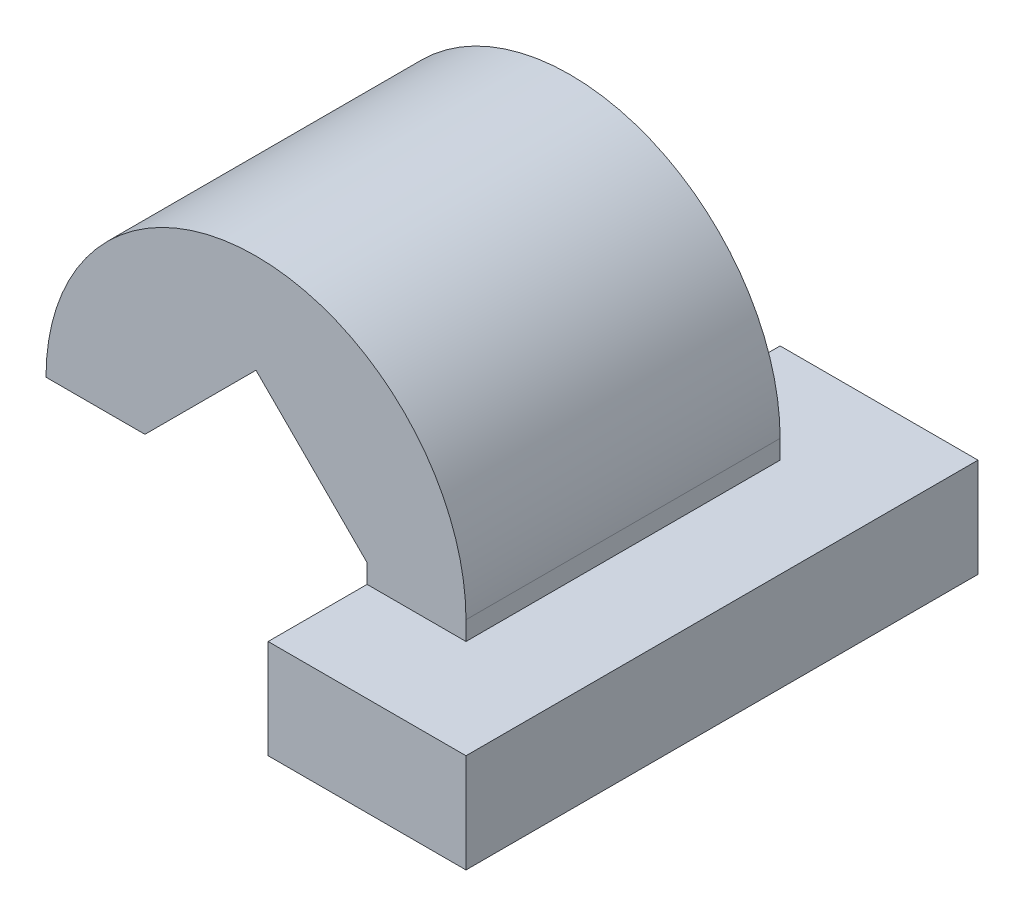
ISO-10303-21;
HEADER;
FILE_DESCRIPTION(('STEP AP214'),'2;1');
FILE_NAME('part.step','',(''),(''),'','','');
FILE_SCHEMA(('AUTOMOTIVE_DESIGN { 1 0 10303 214 1 1 1 1 }'));
ENDSEC;
DATA;
#1=APPLICATION_CONTEXT('core data for automotive mechanical design processes');
#2=APPLICATION_PROTOCOL_DEFINITION('international standard','automotive_design',2000,#1);
#3=PRODUCT_CONTEXT('',#1,'mechanical');
#4=PRODUCT('Part','Part','',(#3));
#5=PRODUCT_RELATED_PRODUCT_CATEGORY('part','',(#4));
#6=PRODUCT_DEFINITION_FORMATION('','',#4);
#7=PRODUCT_DEFINITION_CONTEXT('part definition',#1,'design');
#8=PRODUCT_DEFINITION('design','',#6,#7);
#9=PRODUCT_DEFINITION_SHAPE('','',#8);
#10=(LENGTH_UNIT() NAMED_UNIT(*) SI_UNIT(.MILLI.,.METRE.));
#11=(NAMED_UNIT(*) PLANE_ANGLE_UNIT() SI_UNIT($,.RADIAN.));
#12=(NAMED_UNIT(*) SI_UNIT($,.STERADIAN.) SOLID_ANGLE_UNIT());
#13=UNCERTAINTY_MEASURE_WITH_UNIT(LENGTH_MEASURE(1.E-05),#10,'distance_accuracy_value','');
#14=(GEOMETRIC_REPRESENTATION_CONTEXT(3) GLOBAL_UNCERTAINTY_ASSIGNED_CONTEXT((#13)) GLOBAL_UNIT_ASSIGNED_CONTEXT((#10,
#11,#12)) REPRESENTATION_CONTEXT('',''));
#15=CARTESIAN_POINT('',(0.,0.,0.));
#16=DIRECTION('',(0.,0.,1.));
#17=DIRECTION('',(1.,0.,0.));
#18=AXIS2_PLACEMENT_3D('',#15,#16,#17);
#19=CARTESIAN_POINT('',(4.24506403026727,0.,31.75));
#20=DIRECTION('',(-1.,0.,0.));
#21=DIRECTION('',(0.,-1.,0.));
#22=AXIS2_PLACEMENT_3D('',#19,#20,#21);
#23=PLANE('',#22);
#24=DIRECTION('',(0.,0.,-1.));
#25=VECTOR('',#24,1.);
#26=CARTESIAN_POINT('',(4.24506403026728,2.,31.75));
#27=LINE('',#26,#25);
#28=CARTESIAN_POINT('',(4.24506403026728,2.,31.75));
#29=VERTEX_POINT('',#28);
#30=CARTESIAN_POINT('',(4.24506403026728,2.,25.4));
#31=VERTEX_POINT('',#30);
#32=EDGE_CURVE('E47',#29,#31,#27,.T.);
#33=ORIENTED_EDGE('',*,*,#32,.F.);
#34=DIRECTION('',(0.,-1.,0.));
#35=VECTOR('',#34,1.);
#36=CARTESIAN_POINT('',(4.24506403026728,4.38125,31.75));
#37=LINE('',#36,#35);
#38=CARTESIAN_POINT('',(4.24506403026727,0.,31.75));
#39=VERTEX_POINT('',#38);
#40=EDGE_CURVE('E180',#29,#39,#37,.T.);
#41=ORIENTED_EDGE('',*,*,#40,.T.);
#42=DIRECTION('',(0.,0.,-1.));
#43=VECTOR('',#42,1.);
#44=CARTESIAN_POINT('',(4.24506403026727,0.,31.75));
#45=LINE('',#44,#43);
#46=CARTESIAN_POINT('',(4.24506403026727,0.,25.4));
#47=VERTEX_POINT('',#46);
#48=EDGE_CURVE('E140',#39,#47,#45,.T.);
#49=ORIENTED_EDGE('',*,*,#48,.T.);
#50=DIRECTION('',(0.,1.,0.));
#51=VECTOR('',#50,1.);
#52=CARTESIAN_POINT('',(4.24506403026727,0.,25.4));
#53=LINE('',#52,#51);
#54=EDGE_CURVE('E163',#47,#31,#53,.T.);
#55=ORIENTED_EDGE('',*,*,#54,.T.);
#56=EDGE_LOOP('',(#33,#41,#49,#55));
#57=FACE_BOUND('',#56,.T.);
#58=ADVANCED_FACE('F32',(#57),#23,.F.);
#59=CARTESIAN_POINT('',(0.,4.38125,31.75));
#60=DIRECTION('',(0.,0.,-1.));
#61=DIRECTION('',(-1.,0.,0.));
#62=AXIS2_PLACEMENT_3D('',#59,#60,#61);
#63=PLANE('',#62);
#64=DIRECTION('',(1.,0.,0.));
#65=VECTOR('',#64,1.);
#66=CARTESIAN_POINT('',(0.,2.,31.75));
#67=LINE('',#66,#65);
#68=CARTESIAN_POINT('',(2.24506403026728,2.,31.75));
#69=VERTEX_POINT('',#68);
#70=EDGE_CURVE('E188',#69,#29,#67,.T.);
#71=ORIENTED_EDGE('',*,*,#70,.F.);
#72=DIRECTION('',(0.,-1.,0.));
#73=VECTOR('',#72,1.);
#74=CARTESIAN_POINT('',(2.24506403026728,2.,31.75));
#75=LINE('',#74,#73);
#76=CARTESIAN_POINT('',(2.24506403026728,0.,31.75));
#77=VERTEX_POINT('',#76);
#78=EDGE_CURVE('E122',#69,#77,#75,.T.);
#79=ORIENTED_EDGE('',*,*,#78,.T.);
#80=DIRECTION('',(1.,0.,0.));
#81=VECTOR('',#80,1.);
#82=CARTESIAN_POINT('',(2.24506403026728,0.,31.75));
#83=LINE('',#82,#81);
#84=EDGE_CURVE('E174',#77,#39,#83,.T.);
#85=ORIENTED_EDGE('',*,*,#84,.T.);
#86=ORIENTED_EDGE('',*,*,#40,.F.);
#87=EDGE_LOOP('',(#71,#79,#85,#86));
#88=FACE_BOUND('',#87,.T.);
#89=ADVANCED_FACE('F293',(#88),#63,.F.);
#90=CARTESIAN_POINT('',(0.,4.38125,25.4));
#91=DIRECTION('',(0.,0.,-1.));
#92=DIRECTION('',(-1.,0.,0.));
#93=AXIS2_PLACEMENT_3D('',#90,#91,#92);
#94=PLANE('',#93);
#95=DIRECTION('',(0.,-1.,0.));
#96=VECTOR('',#95,1.);
#97=CARTESIAN_POINT('',(2.24506403026728,4.38125000000001,25.4));
#98=LINE('',#97,#96);
#99=CARTESIAN_POINT('',(2.24506403026728,2.,25.4));
#100=VERTEX_POINT('',#99);
#101=CARTESIAN_POINT('',(2.24506403026728,0.,25.4));
#102=VERTEX_POINT('',#101);
#103=EDGE_CURVE('E160',#100,#102,#98,.T.);
#104=ORIENTED_EDGE('',*,*,#103,.F.);
#105=DIRECTION('',(1.,0.,0.));
#106=VECTOR('',#105,1.);
#107=CARTESIAN_POINT('',(0.,2.,25.4));
#108=LINE('',#107,#106);
#109=EDGE_CURVE('E40',#100,#31,#108,.T.);
#110=ORIENTED_EDGE('',*,*,#109,.T.);
#111=ORIENTED_EDGE('',*,*,#54,.F.);
#112=DIRECTION('',(1.,0.,0.));
#113=VECTOR('',#112,1.);
#114=CARTESIAN_POINT('',(2.24506403026728,0.,25.4));
#115=LINE('',#114,#113);
#116=EDGE_CURVE('E161',#102,#47,#115,.T.);
#117=ORIENTED_EDGE('',*,*,#116,.F.);
#118=EDGE_LOOP('',(#104,#110,#111,#117));
#119=FACE_BOUND('',#118,.T.);
#120=ADVANCED_FACE('F287',(#119),#94,.T.);
#121=CARTESIAN_POINT('',(-2.24506403026728,4.38125,31.75));
#122=DIRECTION('',(0.,-1.,0.));
#123=DIRECTION('',(1.,0.,0.));
#124=AXIS2_PLACEMENT_3D('',#121,#122,#123);
#125=PLANE('',#124);
#126=DIRECTION('',(-1.,0.,0.));
#127=VECTOR('',#126,1.);
#128=CARTESIAN_POINT('',(-2.24506403026728,4.38125,25.4));
#129=LINE('',#128,#127);
#130=CARTESIAN_POINT('',(-2.24506403026728,4.38125,25.4));
#131=VERTEX_POINT('',#130);
#132=CARTESIAN_POINT('',(-4.24506403026728,4.38125,25.4));
#133=VERTEX_POINT('',#132);
#134=EDGE_CURVE('E169',#131,#133,#129,.T.);
#135=ORIENTED_EDGE('',*,*,#134,.F.);
#136=DIRECTION('',(0.,0.,-1.));
#137=VECTOR('',#136,1.);
#138=CARTESIAN_POINT('',(-2.24506403026728,4.38125,31.75));
#139=LINE('',#138,#137);
#140=CARTESIAN_POINT('',(-2.24506403026728,4.38125,31.75));
#141=VERTEX_POINT('',#140);
#142=EDGE_CURVE('E56',#141,#131,#139,.T.);
#143=ORIENTED_EDGE('',*,*,#142,.F.);
#144=DIRECTION('',(-1.,0.,0.));
#145=VECTOR('',#144,1.);
#146=CARTESIAN_POINT('',(-2.24506403026728,4.38125,31.75));
#147=LINE('',#146,#145);
#148=CARTESIAN_POINT('',(-4.24506403026728,4.38125,31.75));
#149=VERTEX_POINT('',#148);
#150=EDGE_CURVE('E156',#141,#149,#147,.T.);
#151=ORIENTED_EDGE('',*,*,#150,.T.);
#152=DIRECTION('',(0.,0.,-1.));
#153=VECTOR('',#152,1.);
#154=CARTESIAN_POINT('',(-4.24506403026728,4.38125,31.75));
#155=LINE('',#154,#153);
#156=EDGE_CURVE('E91',#149,#133,#155,.T.);
#157=ORIENTED_EDGE('',*,*,#156,.T.);
#158=EDGE_LOOP('',(#135,#143,#151,#157));
#159=FACE_BOUND('',#158,.T.);
#160=ADVANCED_FACE('F34',(#159),#125,.T.);
#161=CARTESIAN_POINT('',(-2.24506403026728,4.38125,31.75));
#162=DIRECTION('',(-0.707106781186549,0.707106781186546,0.));
#163=DIRECTION('',(-0.707106781186546,-0.707106781186549,0.));
#164=AXIS2_PLACEMENT_3D('',#161,#162,#163);
#165=PLANE('',#164);
#166=DIRECTION('',(0.707106781186546,0.707106781186549,0.));
#167=VECTOR('',#166,1.);
#168=CARTESIAN_POINT('',(-2.24506403026728,4.38125,25.4));
#169=LINE('',#168,#167);
#170=CARTESIAN_POINT('',(0.,6.62631403026729,25.4));
#171=VERTEX_POINT('',#170);
#172=EDGE_CURVE('E154',#131,#171,#169,.T.);
#173=ORIENTED_EDGE('',*,*,#172,.T.);
#174=DIRECTION('',(0.,0.,-1.));
#175=VECTOR('',#174,1.);
#176=CARTESIAN_POINT('',(0.,6.62631403026729,31.75));
#177=LINE('',#176,#175);
#178=CARTESIAN_POINT('',(0.,6.62631403026729,31.75));
#179=VERTEX_POINT('',#178);
#180=EDGE_CURVE('E135',#179,#171,#177,.T.);
#181=ORIENTED_EDGE('',*,*,#180,.F.);
#182=DIRECTION('',(0.707106781186546,0.707106781186549,0.));
#183=VECTOR('',#182,1.);
#184=CARTESIAN_POINT('',(-2.24506403026728,4.38125,31.75));
#185=LINE('',#184,#183);
#186=EDGE_CURVE('E127',#141,#179,#185,.T.);
#187=ORIENTED_EDGE('',*,*,#186,.F.);
#188=ORIENTED_EDGE('',*,*,#142,.T.);
#189=EDGE_LOOP('',(#173,#181,#187,#188));
#190=FACE_BOUND('',#189,.T.);
#191=ADVANCED_FACE('F286',(#190),#165,.F.);
#192=CARTESIAN_POINT('',(0.,6.62631403026729,31.75));
#193=DIRECTION('',(0.707106781186546,0.707106781186549,0.));
#194=DIRECTION('',(-0.707106781186549,0.707106781186546,0.));
#195=AXIS2_PLACEMENT_3D('',#192,#193,#194);
#196=PLANE('',#195);
#197=DIRECTION('',(0.707106781186549,-0.707106781186546,0.));
#198=VECTOR('',#197,1.);
#199=CARTESIAN_POINT('',(0.,6.62631403026729,25.4));
#200=LINE('',#199,#198);
#201=CARTESIAN_POINT('',(2.24506403026728,4.38125000000001,25.4));
#202=VERTEX_POINT('',#201);
#203=EDGE_CURVE('E134',#171,#202,#200,.T.);
#204=ORIENTED_EDGE('',*,*,#203,.T.);
#205=DIRECTION('',(0.,0.,-1.));
#206=VECTOR('',#205,1.);
#207=CARTESIAN_POINT('',(2.24506403026728,4.38125000000001,31.75));
#208=LINE('',#207,#206);
#209=CARTESIAN_POINT('',(2.24506403026728,4.38125000000001,31.75));
#210=VERTEX_POINT('',#209);
#211=EDGE_CURVE('E113',#210,#202,#208,.T.);
#212=ORIENTED_EDGE('',*,*,#211,.F.);
#213=DIRECTION('',(0.707106781186549,-0.707106781186546,0.));
#214=VECTOR('',#213,1.);
#215=CARTESIAN_POINT('',(0.,6.62631403026729,31.75));
#216=LINE('',#215,#214);
#217=EDGE_CURVE('E121',#179,#210,#216,.T.);
#218=ORIENTED_EDGE('',*,*,#217,.F.);
#219=ORIENTED_EDGE('',*,*,#180,.T.);
#220=EDGE_LOOP('',(#204,#212,#218,#219));
#221=FACE_BOUND('',#220,.T.);
#222=ADVANCED_FACE('F132',(#221),#196,.F.);
#223=CARTESIAN_POINT('',(2.24506403026728,4.38125000000001,31.75));
#224=DIRECTION('',(1.,0.,0.));
#225=DIRECTION('',(0.,0.,-1.));
#226=AXIS2_PLACEMENT_3D('',#223,#224,#225);
#227=PLANE('',#226);
#228=CARTESIAN_POINT('',(2.24506403026728,4.,25.4));
#229=VERTEX_POINT('',#228);
#230=EDGE_CURVE('E158',#202,#229,#98,.T.);
#231=ORIENTED_EDGE('',*,*,#230,.T.);
#232=DIRECTION('',(0.,0.,1.));
#233=VECTOR('',#232,1.);
#234=CARTESIAN_POINT('',(2.24506403026728,4.,23.4));
#235=LINE('',#234,#233);
#236=CARTESIAN_POINT('',(2.24506403026728,4.,23.4));
#237=VERTEX_POINT('',#236);
#238=EDGE_CURVE('E225',#237,#229,#235,.T.);
#239=ORIENTED_EDGE('',*,*,#238,.F.);
#240=DIRECTION('',(0.,-1.,0.));
#241=VECTOR('',#240,1.);
#242=CARTESIAN_POINT('',(2.24506403026728,4.,23.4));
#243=LINE('',#242,#241);
#244=CARTESIAN_POINT('',(2.24506403026728,2.,23.4));
#245=VERTEX_POINT('',#244);
#246=EDGE_CURVE('E200',#237,#245,#243,.T.);
#247=ORIENTED_EDGE('',*,*,#246,.T.);
#248=DIRECTION('',(0.,0.,1.));
#249=VECTOR('',#248,1.);
#250=CARTESIAN_POINT('',(2.24506403026728,2.,23.4));
#251=LINE('',#250,#249);
#252=EDGE_CURVE('E213',#245,#100,#251,.T.);
#253=ORIENTED_EDGE('',*,*,#252,.T.);
#254=ORIENTED_EDGE('',*,*,#103,.T.);
#255=DIRECTION('',(0.,0.,-1.));
#256=VECTOR('',#255,1.);
#257=CARTESIAN_POINT('',(2.24506403026728,0.,31.75));
#258=LINE('',#257,#256);
#259=EDGE_CURVE('E136',#77,#102,#258,.T.);
#260=ORIENTED_EDGE('',*,*,#259,.F.);
#261=ORIENTED_EDGE('',*,*,#78,.F.);
#262=CARTESIAN_POINT('',(2.24506403026728,2.,33.75));
#263=VERTEX_POINT('',#262);
#264=EDGE_CURVE('E216',#69,#263,#251,.T.);
#265=ORIENTED_EDGE('',*,*,#264,.T.);
#266=DIRECTION('',(0.,-1.,0.));
#267=VECTOR('',#266,1.);
#268=CARTESIAN_POINT('',(2.24506403026728,4.,33.75));
#269=LINE('',#268,#267);
#270=CARTESIAN_POINT('',(2.24506403026728,4.,33.75));
#271=VERTEX_POINT('',#270);
#272=EDGE_CURVE('E191',#271,#263,#269,.T.);
#273=ORIENTED_EDGE('',*,*,#272,.F.);
#274=CARTESIAN_POINT('',(2.24506403026728,4.,31.75));
#275=VERTEX_POINT('',#274);
#276=EDGE_CURVE('E118',#275,#271,#235,.T.);
#277=ORIENTED_EDGE('',*,*,#276,.F.);
#278=EDGE_CURVE('E108',#210,#275,#75,.T.);
#279=ORIENTED_EDGE('',*,*,#278,.F.);
#280=ORIENTED_EDGE('',*,*,#211,.T.);
#281=EDGE_LOOP('',(#231,#239,#247,#253,#254,#260,#261,#265,#273,#277,#279,#280));
#282=FACE_BOUND('',#281,.T.);
#283=ADVANCED_FACE('F111',(#282),#227,.F.);
#284=CARTESIAN_POINT('',(2.24506403026728,0.,31.75));
#285=DIRECTION('',(0.,1.,0.));
#286=DIRECTION('',(-1.,0.,0.));
#287=AXIS2_PLACEMENT_3D('',#284,#285,#286);
#288=PLANE('',#287);
#289=ORIENTED_EDGE('',*,*,#116,.T.);
#290=ORIENTED_EDGE('',*,*,#48,.F.);
#291=ORIENTED_EDGE('',*,*,#84,.F.);
#292=ORIENTED_EDGE('',*,*,#259,.T.);
#293=EDGE_LOOP('',(#289,#290,#291,#292));
#294=FACE_BOUND('',#293,.T.);
#295=ADVANCED_FACE('F305',(#294),#288,.F.);
#296=CARTESIAN_POINT('',(4.24506403026728,4.38125,31.75));
#297=VERTEX_POINT('',#296);
#298=CARTESIAN_POINT('',(4.24506403026729,4.,31.75));
#299=VERTEX_POINT('',#298);
#300=EDGE_CURVE('E177',#297,#299,#37,.T.);
#301=ORIENTED_EDGE('',*,*,#300,.T.);
#302=DIRECTION('',(0.,0.,-1.));
#303=VECTOR('',#302,1.);
#304=CARTESIAN_POINT('',(4.24506403026729,4.,31.75));
#305=LINE('',#304,#303);
#306=CARTESIAN_POINT('',(4.24506403026728,4.,25.4));
#307=VERTEX_POINT('',#306);
#308=EDGE_CURVE('E185',#299,#307,#305,.T.);
#309=ORIENTED_EDGE('',*,*,#308,.T.);
#310=CARTESIAN_POINT('',(4.24506403026728,4.38125,25.4));
#311=VERTEX_POINT('',#310);
#312=EDGE_CURVE('E165',#307,#311,#53,.T.);
#313=ORIENTED_EDGE('',*,*,#312,.T.);
#314=DIRECTION('',(0.,0.,-1.));
#315=VECTOR('',#314,1.);
#316=CARTESIAN_POINT('',(4.24506403026728,4.38125,31.75));
#317=LINE('',#316,#315);
#318=EDGE_CURVE('E146',#297,#311,#317,.T.);
#319=ORIENTED_EDGE('',*,*,#318,.F.);
#320=EDGE_LOOP('',(#301,#309,#313,#319));
#321=FACE_BOUND('',#320,.T.);
#322=ADVANCED_FACE('F281',(#321),#23,.F.);
#323=CARTESIAN_POINT('',(0.,4.38125,31.75));
#324=DIRECTION('',(0.,0.,-1.));
#325=DIRECTION('',(-1.,0.,0.));
#326=AXIS2_PLACEMENT_3D('',#323,#324,#325);
#327=CYLINDRICAL_SURFACE('',#326,4.24506403026728);
#328=CARTESIAN_POINT('',(0.,4.38125,25.4));
#329=DIRECTION('',(0.,0.,-1.));
#330=DIRECTION('',(-1.,0.,0.));
#331=AXIS2_PLACEMENT_3D('',#328,#329,#330);
#332=CIRCLE('',#331,4.24506403026728);
#333=EDGE_CURVE('E166',#133,#311,#332,.T.);
#334=ORIENTED_EDGE('',*,*,#333,.F.);
#335=ORIENTED_EDGE('',*,*,#156,.F.);
#336=CARTESIAN_POINT('',(0.,4.38125,31.75));
#337=DIRECTION('',(0.,0.,-1.));
#338=DIRECTION('',(-1.,0.,0.));
#339=AXIS2_PLACEMENT_3D('',#336,#337,#338);
#340=CIRCLE('',#339,4.24506403026728);
#341=EDGE_CURVE('E181',#149,#297,#340,.T.);
#342=ORIENTED_EDGE('',*,*,#341,.T.);
#343=ORIENTED_EDGE('',*,*,#318,.T.);
#344=EDGE_LOOP('',(#334,#335,#342,#343));
#345=FACE_BOUND('',#344,.T.);
#346=ADVANCED_FACE('F282',(#345),#327,.T.);
#347=ORIENTED_EDGE('',*,*,#278,.T.);
#348=DIRECTION('',(1.,0.,0.));
#349=VECTOR('',#348,1.);
#350=CARTESIAN_POINT('',(0.,4.,31.75));
#351=LINE('',#350,#349);
#352=EDGE_CURVE('E172',#275,#299,#351,.T.);
#353=ORIENTED_EDGE('',*,*,#352,.T.);
#354=ORIENTED_EDGE('',*,*,#300,.F.);
#355=ORIENTED_EDGE('',*,*,#341,.F.);
#356=ORIENTED_EDGE('',*,*,#150,.F.);
#357=ORIENTED_EDGE('',*,*,#186,.T.);
#358=ORIENTED_EDGE('',*,*,#217,.T.);
#359=EDGE_LOOP('',(#347,#353,#354,#355,#356,#357,#358));
#360=FACE_BOUND('',#359,.T.);
#361=ADVANCED_FACE('F125',(#360),#63,.F.);
#362=DIRECTION('',(1.,0.,0.));
#363=VECTOR('',#362,1.);
#364=CARTESIAN_POINT('',(0.,4.,25.4));
#365=LINE('',#364,#363);
#366=EDGE_CURVE('E11',#229,#307,#365,.T.);
#367=ORIENTED_EDGE('',*,*,#366,.F.);
#368=ORIENTED_EDGE('',*,*,#230,.F.);
#369=ORIENTED_EDGE('',*,*,#203,.F.);
#370=ORIENTED_EDGE('',*,*,#172,.F.);
#371=ORIENTED_EDGE('',*,*,#134,.T.);
#372=ORIENTED_EDGE('',*,*,#333,.T.);
#373=ORIENTED_EDGE('',*,*,#312,.F.);
#374=EDGE_LOOP('',(#367,#368,#369,#370,#371,#372,#373));
#375=FACE_BOUND('',#374,.T.);
#376=ADVANCED_FACE('F284',(#375),#94,.T.);
#377=CARTESIAN_POINT('',(0.,4.,0.));
#378=DIRECTION('',(0.,1.,0.));
#379=DIRECTION('',(0.,0.,1.));
#380=AXIS2_PLACEMENT_3D('',#377,#378,#379);
#381=PLANE('',#380);
#382=ORIENTED_EDGE('',*,*,#352,.F.);
#383=ORIENTED_EDGE('',*,*,#276,.T.);
#384=DIRECTION('',(1.,0.,0.));
#385=VECTOR('',#384,1.);
#386=CARTESIAN_POINT('',(2.24506403026728,4.,33.75));
#387=LINE('',#386,#385);
#388=CARTESIAN_POINT('',(6.24506403026728,4.,33.75));
#389=VERTEX_POINT('',#388);
#390=EDGE_CURVE('E222',#271,#389,#387,.T.);
#391=ORIENTED_EDGE('',*,*,#390,.T.);
#392=DIRECTION('',(0.,0.,-1.));
#393=VECTOR('',#392,1.);
#394=CARTESIAN_POINT('',(6.24506403026727,4.,23.4));
#395=LINE('',#394,#393);
#396=CARTESIAN_POINT('',(6.24506403026727,4.,23.4));
#397=VERTEX_POINT('',#396);
#398=EDGE_CURVE('E219',#389,#397,#395,.T.);
#399=ORIENTED_EDGE('',*,*,#398,.T.);
#400=DIRECTION('',(-1.,0.,0.));
#401=VECTOR('',#400,1.);
#402=CARTESIAN_POINT('',(2.24506403026728,4.,23.4));
#403=LINE('',#402,#401);
#404=EDGE_CURVE('E203',#397,#237,#403,.T.);
#405=ORIENTED_EDGE('',*,*,#404,.T.);
#406=ORIENTED_EDGE('',*,*,#238,.T.);
#407=ORIENTED_EDGE('',*,*,#366,.T.);
#408=ORIENTED_EDGE('',*,*,#308,.F.);
#409=EDGE_LOOP('',(#382,#383,#391,#399,#405,#406,#407,#408));
#410=FACE_BOUND('',#409,.T.);
#411=ADVANCED_FACE('F234',(#410),#381,.T.);
#412=CARTESIAN_POINT('',(0.,2.,0.));
#413=DIRECTION('',(0.,1.,0.));
#414=DIRECTION('',(0.,0.,1.));
#415=AXIS2_PLACEMENT_3D('',#412,#413,#414);
#416=PLANE('',#415);
#417=ORIENTED_EDGE('',*,*,#264,.F.);
#418=ORIENTED_EDGE('',*,*,#70,.T.);
#419=ORIENTED_EDGE('',*,*,#32,.T.);
#420=ORIENTED_EDGE('',*,*,#109,.F.);
#421=ORIENTED_EDGE('',*,*,#252,.F.);
#422=DIRECTION('',(-1.,0.,0.));
#423=VECTOR('',#422,1.);
#424=CARTESIAN_POINT('',(2.24506403026728,2.,23.4));
#425=LINE('',#424,#423);
#426=CARTESIAN_POINT('',(6.24506403026727,2.,23.4));
#427=VERTEX_POINT('',#426);
#428=EDGE_CURVE('E204',#427,#245,#425,.T.);
#429=ORIENTED_EDGE('',*,*,#428,.F.);
#430=DIRECTION('',(0.,0.,-1.));
#431=VECTOR('',#430,1.);
#432=CARTESIAN_POINT('',(6.24506403026727,2.,23.4));
#433=LINE('',#432,#431);
#434=CARTESIAN_POINT('',(6.24506403026728,2.,33.75));
#435=VERTEX_POINT('',#434);
#436=EDGE_CURVE('E207',#435,#427,#433,.T.);
#437=ORIENTED_EDGE('',*,*,#436,.F.);
#438=DIRECTION('',(1.,0.,0.));
#439=VECTOR('',#438,1.);
#440=CARTESIAN_POINT('',(2.24506403026728,2.,33.75));
#441=LINE('',#440,#439);
#442=EDGE_CURVE('E210',#263,#435,#441,.T.);
#443=ORIENTED_EDGE('',*,*,#442,.F.);
#444=EDGE_LOOP('',(#417,#418,#419,#420,#421,#429,#437,#443));
#445=FACE_BOUND('',#444,.T.);
#446=ADVANCED_FACE('F254',(#445),#416,.F.);
#447=CARTESIAN_POINT('',(2.24506403026728,4.,33.75));
#448=DIRECTION('',(0.,0.,-1.));
#449=DIRECTION('',(-1.,0.,0.));
#450=AXIS2_PLACEMENT_3D('',#447,#448,#449);
#451=PLANE('',#450);
#452=ORIENTED_EDGE('',*,*,#442,.T.);
#453=DIRECTION('',(0.,-1.,0.));
#454=VECTOR('',#453,1.);
#455=CARTESIAN_POINT('',(6.24506403026728,4.,33.75));
#456=LINE('',#455,#454);
#457=EDGE_CURVE('E194',#389,#435,#456,.T.);
#458=ORIENTED_EDGE('',*,*,#457,.F.);
#459=ORIENTED_EDGE('',*,*,#390,.F.);
#460=ORIENTED_EDGE('',*,*,#272,.T.);
#461=EDGE_LOOP('',(#452,#458,#459,#460));
#462=FACE_BOUND('',#461,.T.);
#463=ADVANCED_FACE('F241',(#462),#451,.F.);
#464=CARTESIAN_POINT('',(6.24506403026727,4.,23.4));
#465=DIRECTION('',(-1.,0.,0.));
#466=DIRECTION('',(0.,0.,1.));
#467=AXIS2_PLACEMENT_3D('',#464,#465,#466);
#468=PLANE('',#467);
#469=ORIENTED_EDGE('',*,*,#436,.T.);
#470=DIRECTION('',(0.,-1.,0.));
#471=VECTOR('',#470,1.);
#472=CARTESIAN_POINT('',(6.24506403026727,4.,23.4));
#473=LINE('',#472,#471);
#474=EDGE_CURVE('E197',#397,#427,#473,.T.);
#475=ORIENTED_EDGE('',*,*,#474,.F.);
#476=ORIENTED_EDGE('',*,*,#398,.F.);
#477=ORIENTED_EDGE('',*,*,#457,.T.);
#478=EDGE_LOOP('',(#469,#475,#476,#477));
#479=FACE_BOUND('',#478,.T.);
#480=ADVANCED_FACE('F259',(#479),#468,.F.);
#481=CARTESIAN_POINT('',(2.24506403026728,4.,23.4));
#482=DIRECTION('',(0.,0.,1.));
#483=DIRECTION('',(1.,0.,0.));
#484=AXIS2_PLACEMENT_3D('',#481,#482,#483);
#485=PLANE('',#484);
#486=ORIENTED_EDGE('',*,*,#428,.T.);
#487=ORIENTED_EDGE('',*,*,#246,.F.);
#488=ORIENTED_EDGE('',*,*,#404,.F.);
#489=ORIENTED_EDGE('',*,*,#474,.T.);
#490=EDGE_LOOP('',(#486,#487,#488,#489));
#491=FACE_BOUND('',#490,.T.);
#492=ADVANCED_FACE('F324',(#491),#485,.F.);
#493=CLOSED_SHELL('',(#58,#89,#120,#160,#191,#222,#283,#295,#322,#346,#361,#376,#411,#446,#463,
#480,#492));
#494=MANIFOLD_SOLID_BREP('B2',#493);
#495=ADVANCED_BREP_SHAPE_REPRESENTATION('',(#18,#494),#14);
#496=SHAPE_DEFINITION_REPRESENTATION(#9,#495);
ENDSEC;
END-ISO-10303-21;
